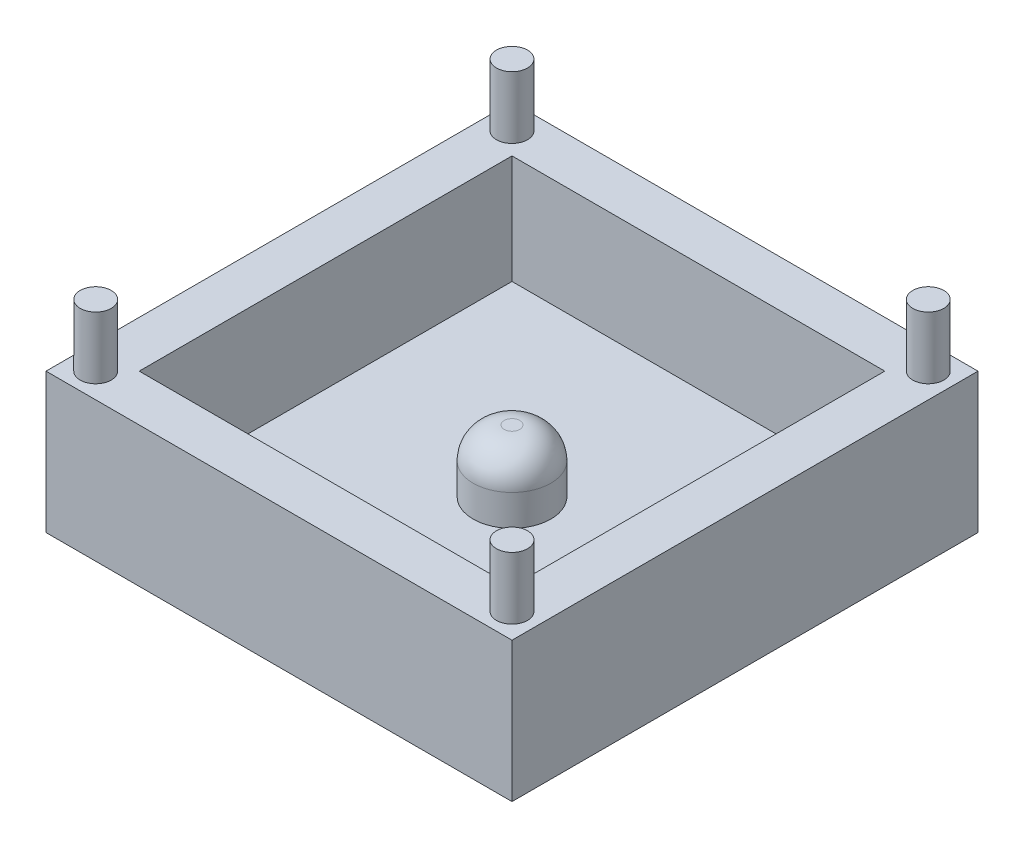
ISO-10303-21;
HEADER;
FILE_DESCRIPTION(('STEP AP214'),'2;1');
FILE_NAME('part.step','',(''),(''),'','','');
FILE_SCHEMA(('AUTOMOTIVE_DESIGN { 1 0 10303 214 1 1 1 1 }'));
ENDSEC;
DATA;
#1=APPLICATION_CONTEXT('core data for automotive mechanical design processes');
#2=APPLICATION_PROTOCOL_DEFINITION('international standard','automotive_design',2000,#1);
#3=PRODUCT_CONTEXT('',#1,'mechanical');
#4=PRODUCT('Part','Part','',(#3));
#5=PRODUCT_RELATED_PRODUCT_CATEGORY('part','',(#4));
#6=PRODUCT_DEFINITION_FORMATION('','',#4);
#7=PRODUCT_DEFINITION_CONTEXT('part definition',#1,'design');
#8=PRODUCT_DEFINITION('design','',#6,#7);
#9=PRODUCT_DEFINITION_SHAPE('','',#8);
#10=(LENGTH_UNIT() NAMED_UNIT(*) SI_UNIT(.MILLI.,.METRE.));
#11=(NAMED_UNIT(*) PLANE_ANGLE_UNIT() SI_UNIT($,.RADIAN.));
#12=(NAMED_UNIT(*) SI_UNIT($,.STERADIAN.) SOLID_ANGLE_UNIT());
#13=UNCERTAINTY_MEASURE_WITH_UNIT(LENGTH_MEASURE(1.E-05),#10,'distance_accuracy_value','');
#14=(GEOMETRIC_REPRESENTATION_CONTEXT(3) GLOBAL_UNCERTAINTY_ASSIGNED_CONTEXT((#13)) GLOBAL_UNIT_ASSIGNED_CONTEXT((#10,
#11,#12)) REPRESENTATION_CONTEXT('',''));
#15=CARTESIAN_POINT('',(0.,0.,0.));
#16=DIRECTION('',(0.,0.,1.));
#17=DIRECTION('',(1.,0.,0.));
#18=AXIS2_PLACEMENT_3D('',#15,#16,#17);
#19=CARTESIAN_POINT('',(7.5,4.5,7.5));
#20=DIRECTION('',(-1.,0.,0.));
#21=DIRECTION('',(0.,0.,1.));
#22=AXIS2_PLACEMENT_3D('',#19,#20,#21);
#23=PLANE('',#22);
#24=DIRECTION('',(0.,0.,-1.));
#25=VECTOR('',#24,1.);
#26=CARTESIAN_POINT('',(7.5,0.,7.5));
#27=LINE('',#26,#25);
#28=CARTESIAN_POINT('',(7.5,0.,7.5));
#29=VERTEX_POINT('',#28);
#30=CARTESIAN_POINT('',(7.5,0.,-7.5));
#31=VERTEX_POINT('',#30);
#32=EDGE_CURVE('E146',#29,#31,#27,.T.);
#33=ORIENTED_EDGE('',*,*,#32,.T.);
#34=DIRECTION('',(0.,-1.,0.));
#35=VECTOR('',#34,1.);
#36=CARTESIAN_POINT('',(7.5,4.5,-7.5));
#37=LINE('',#36,#35);
#38=CARTESIAN_POINT('',(7.5,4.5,-7.5));
#39=VERTEX_POINT('',#38);
#40=EDGE_CURVE('E170',#39,#31,#37,.T.);
#41=ORIENTED_EDGE('',*,*,#40,.F.);
#42=DIRECTION('',(0.,0.,-1.));
#43=VECTOR('',#42,1.);
#44=CARTESIAN_POINT('',(7.5,4.5,7.5));
#45=LINE('',#44,#43);
#46=CARTESIAN_POINT('',(7.5,4.5,7.5));
#47=VERTEX_POINT('',#46);
#48=EDGE_CURVE('E150',#47,#39,#45,.T.);
#49=ORIENTED_EDGE('',*,*,#48,.F.);
#50=DIRECTION('',(0.,-1.,0.));
#51=VECTOR('',#50,1.);
#52=CARTESIAN_POINT('',(7.5,4.5,7.5));
#53=LINE('',#52,#51);
#54=EDGE_CURVE('E156',#47,#29,#53,.T.);
#55=ORIENTED_EDGE('',*,*,#54,.T.);
#56=EDGE_LOOP('',(#33,#41,#49,#55));
#57=FACE_BOUND('',#56,.T.);
#58=ADVANCED_FACE('F33',(#57),#23,.F.);
#59=CARTESIAN_POINT('',(-7.5,4.5,-7.5));
#60=DIRECTION('',(0.,0.,1.));
#61=DIRECTION('',(1.,0.,0.));
#62=AXIS2_PLACEMENT_3D('',#59,#60,#61);
#63=PLANE('',#62);
#64=DIRECTION('',(-1.,0.,0.));
#65=VECTOR('',#64,1.);
#66=CARTESIAN_POINT('',(-7.5,0.,-7.5));
#67=LINE('',#66,#65);
#68=CARTESIAN_POINT('',(-7.5,0.,-7.5));
#69=VERTEX_POINT('',#68);
#70=EDGE_CURVE('E159',#31,#69,#67,.T.);
#71=ORIENTED_EDGE('',*,*,#70,.T.);
#72=DIRECTION('',(0.,-1.,0.));
#73=VECTOR('',#72,1.);
#74=CARTESIAN_POINT('',(-7.5,4.5,-7.5));
#75=LINE('',#74,#73);
#76=CARTESIAN_POINT('',(-7.5,4.5,-7.5));
#77=VERTEX_POINT('',#76);
#78=EDGE_CURVE('E167',#77,#69,#75,.T.);
#79=ORIENTED_EDGE('',*,*,#78,.F.);
#80=DIRECTION('',(-1.,0.,0.));
#81=VECTOR('',#80,1.);
#82=CARTESIAN_POINT('',(-7.5,4.5,-7.5));
#83=LINE('',#82,#81);
#84=EDGE_CURVE('E86',#39,#77,#83,.T.);
#85=ORIENTED_EDGE('',*,*,#84,.F.);
#86=ORIENTED_EDGE('',*,*,#40,.T.);
#87=EDGE_LOOP('',(#71,#79,#85,#86));
#88=FACE_BOUND('',#87,.T.);
#89=ADVANCED_FACE('F207',(#88),#63,.F.);
#90=CARTESIAN_POINT('',(-7.5,4.5,7.5));
#91=DIRECTION('',(1.,0.,0.));
#92=DIRECTION('',(0.,0.,-1.));
#93=AXIS2_PLACEMENT_3D('',#90,#91,#92);
#94=PLANE('',#93);
#95=DIRECTION('',(0.,0.,1.));
#96=VECTOR('',#95,1.);
#97=CARTESIAN_POINT('',(-7.5,0.,7.5));
#98=LINE('',#97,#96);
#99=CARTESIAN_POINT('',(-7.5,0.,7.5));
#100=VERTEX_POINT('',#99);
#101=EDGE_CURVE('E161',#69,#100,#98,.T.);
#102=ORIENTED_EDGE('',*,*,#101,.T.);
#103=DIRECTION('',(0.,-1.,0.));
#104=VECTOR('',#103,1.);
#105=CARTESIAN_POINT('',(-7.5,4.5,7.5));
#106=LINE('',#105,#104);
#107=CARTESIAN_POINT('',(-7.5,4.5,7.5));
#108=VERTEX_POINT('',#107);
#109=EDGE_CURVE('E165',#108,#100,#106,.T.);
#110=ORIENTED_EDGE('',*,*,#109,.F.);
#111=DIRECTION('',(0.,0.,1.));
#112=VECTOR('',#111,1.);
#113=CARTESIAN_POINT('',(-7.5,4.5,7.5));
#114=LINE('',#113,#112);
#115=EDGE_CURVE('E153',#77,#108,#114,.T.);
#116=ORIENTED_EDGE('',*,*,#115,.F.);
#117=ORIENTED_EDGE('',*,*,#78,.T.);
#118=EDGE_LOOP('',(#102,#110,#116,#117));
#119=FACE_BOUND('',#118,.T.);
#120=ADVANCED_FACE('F212',(#119),#94,.F.);
#121=CARTESIAN_POINT('',(-7.5,4.5,7.5));
#122=DIRECTION('',(0.,0.,-1.));
#123=DIRECTION('',(-1.,0.,0.));
#124=AXIS2_PLACEMENT_3D('',#121,#122,#123);
#125=PLANE('',#124);
#126=DIRECTION('',(1.,0.,0.));
#127=VECTOR('',#126,1.);
#128=CARTESIAN_POINT('',(-7.5,0.,7.5));
#129=LINE('',#128,#127);
#130=EDGE_CURVE('E78',#100,#29,#129,.T.);
#131=ORIENTED_EDGE('',*,*,#130,.T.);
#132=ORIENTED_EDGE('',*,*,#54,.F.);
#133=DIRECTION('',(1.,0.,0.));
#134=VECTOR('',#133,1.);
#135=CARTESIAN_POINT('',(-7.5,4.5,7.5));
#136=LINE('',#135,#134);
#137=EDGE_CURVE('E57',#108,#47,#136,.T.);
#138=ORIENTED_EDGE('',*,*,#137,.F.);
#139=ORIENTED_EDGE('',*,*,#109,.T.);
#140=EDGE_LOOP('',(#131,#132,#138,#139));
#141=FACE_BOUND('',#140,.T.);
#142=ADVANCED_FACE('F195',(#141),#125,.F.);
#143=CARTESIAN_POINT('',(0.,4.5,0.));
#144=DIRECTION('',(0.,-1.,0.));
#145=DIRECTION('',(0.,0.,-1.));
#146=AXIS2_PLACEMENT_3D('',#143,#144,#145);
#147=PLANE('',#146);
#148=CARTESIAN_POINT('',(-6.7,4.5,6.7));
#149=DIRECTION('',(0.,-1.,0.));
#150=DIRECTION('',(0.,0.,-1.));
#151=AXIS2_PLACEMENT_3D('',#148,#149,#150);
#152=CIRCLE('',#151,0.500000000000001);
#153=CARTESIAN_POINT('',(-6.7,4.5,6.2));
#154=VERTEX_POINT('',#153);
#155=EDGE_CURVE('E11',#154,#154,#152,.F.);
#156=ORIENTED_EDGE('',*,*,#155,.F.);
#157=EDGE_LOOP('',(#156));
#158=FACE_BOUND('',#157,.T.);
#159=CARTESIAN_POINT('',(6.7,4.5,6.7));
#160=DIRECTION('',(0.,-1.,0.));
#161=DIRECTION('',(0.,0.,-1.));
#162=AXIS2_PLACEMENT_3D('',#159,#160,#161);
#163=CIRCLE('',#162,0.500000000000001);
#164=CARTESIAN_POINT('',(6.7,4.5,6.2));
#165=VERTEX_POINT('',#164);
#166=EDGE_CURVE('E41',#165,#165,#163,.F.);
#167=ORIENTED_EDGE('',*,*,#166,.F.);
#168=EDGE_LOOP('',(#167));
#169=FACE_BOUND('',#168,.T.);
#170=CARTESIAN_POINT('',(6.7,4.5,-6.7));
#171=DIRECTION('',(0.,-1.,0.));
#172=DIRECTION('',(0.,0.,-1.));
#173=AXIS2_PLACEMENT_3D('',#170,#171,#172);
#174=CIRCLE('',#173,0.500000000000001);
#175=CARTESIAN_POINT('',(6.7,4.5,-7.2));
#176=VERTEX_POINT('',#175);
#177=EDGE_CURVE('E184',#176,#176,#174,.F.);
#178=ORIENTED_EDGE('',*,*,#177,.F.);
#179=EDGE_LOOP('',(#178));
#180=FACE_BOUND('',#179,.T.);
#181=CARTESIAN_POINT('',(-6.7,4.5,-6.7));
#182=DIRECTION('',(0.,-1.,0.));
#183=DIRECTION('',(0.,0.,-1.));
#184=AXIS2_PLACEMENT_3D('',#181,#182,#183);
#185=CIRCLE('',#184,0.500000000000001);
#186=CARTESIAN_POINT('',(-6.7,4.5,-7.2));
#187=VERTEX_POINT('',#186);
#188=EDGE_CURVE('E181',#187,#187,#185,.F.);
#189=ORIENTED_EDGE('',*,*,#188,.F.);
#190=EDGE_LOOP('',(#189));
#191=FACE_BOUND('',#190,.T.);
#192=DIRECTION('',(-1.,0.,0.));
#193=VECTOR('',#192,1.);
#194=CARTESIAN_POINT('',(-6.,4.5,-6.));
#195=LINE('',#194,#193);
#196=CARTESIAN_POINT('',(6.,4.5,-6.));
#197=VERTEX_POINT('',#196);
#198=CARTESIAN_POINT('',(-6.,4.5,-6.));
#199=VERTEX_POINT('',#198);
#200=EDGE_CURVE('E140',#197,#199,#195,.T.);
#201=ORIENTED_EDGE('',*,*,#200,.F.);
#202=DIRECTION('',(0.,0.,-1.));
#203=VECTOR('',#202,1.);
#204=CARTESIAN_POINT('',(6.,4.5,6.));
#205=LINE('',#204,#203);
#206=CARTESIAN_POINT('',(6.,4.5,6.));
#207=VERTEX_POINT('',#206);
#208=EDGE_CURVE('E48',#207,#197,#205,.T.);
#209=ORIENTED_EDGE('',*,*,#208,.F.);
#210=DIRECTION('',(1.,0.,0.));
#211=VECTOR('',#210,1.);
#212=CARTESIAN_POINT('',(-6.,4.5,6.));
#213=LINE('',#212,#211);
#214=CARTESIAN_POINT('',(-6.,4.5,6.));
#215=VERTEX_POINT('',#214);
#216=EDGE_CURVE('E128',#215,#207,#213,.T.);
#217=ORIENTED_EDGE('',*,*,#216,.F.);
#218=DIRECTION('',(0.,0.,1.));
#219=VECTOR('',#218,1.);
#220=CARTESIAN_POINT('',(-6.,4.5,6.));
#221=LINE('',#220,#219);
#222=EDGE_CURVE('E131',#199,#215,#221,.T.);
#223=ORIENTED_EDGE('',*,*,#222,.F.);
#224=EDGE_LOOP('',(#201,#209,#217,#223));
#225=FACE_BOUND('',#224,.T.);
#226=ORIENTED_EDGE('',*,*,#48,.T.);
#227=ORIENTED_EDGE('',*,*,#84,.T.);
#228=ORIENTED_EDGE('',*,*,#115,.T.);
#229=ORIENTED_EDGE('',*,*,#137,.T.);
#230=EDGE_LOOP('',(#226,#227,#228,#229));
#231=FACE_BOUND('',#230,.T.);
#232=ADVANCED_FACE('F191',(#158,#169,#180,#191,#225,#231),#147,.F.);
#233=CARTESIAN_POINT('',(0.,0.,0.));
#234=DIRECTION('',(0.,-1.,0.));
#235=DIRECTION('',(0.,0.,-1.));
#236=AXIS2_PLACEMENT_3D('',#233,#234,#235);
#237=PLANE('',#236);
#238=ORIENTED_EDGE('',*,*,#32,.F.);
#239=ORIENTED_EDGE('',*,*,#130,.F.);
#240=ORIENTED_EDGE('',*,*,#101,.F.);
#241=ORIENTED_EDGE('',*,*,#70,.F.);
#242=EDGE_LOOP('',(#238,#239,#240,#241));
#243=FACE_BOUND('',#242,.T.);
#244=ADVANCED_FACE('F194',(#243),#237,.T.);
#245=CARTESIAN_POINT('',(6.,1.,6.));
#246=DIRECTION('',(1.,0.,0.));
#247=DIRECTION('',(0.,0.,-1.));
#248=AXIS2_PLACEMENT_3D('',#245,#246,#247);
#249=PLANE('',#248);
#250=ORIENTED_EDGE('',*,*,#208,.T.);
#251=DIRECTION('',(0.,1.,0.));
#252=VECTOR('',#251,1.);
#253=CARTESIAN_POINT('',(6.,1.,-6.));
#254=LINE('',#253,#252);
#255=CARTESIAN_POINT('',(6.,1.,-6.));
#256=VERTEX_POINT('',#255);
#257=EDGE_CURVE('E106',#256,#197,#254,.T.);
#258=ORIENTED_EDGE('',*,*,#257,.F.);
#259=DIRECTION('',(0.,0.,-1.));
#260=VECTOR('',#259,1.);
#261=CARTESIAN_POINT('',(6.,1.,6.));
#262=LINE('',#261,#260);
#263=CARTESIAN_POINT('',(6.,1.,6.));
#264=VERTEX_POINT('',#263);
#265=EDGE_CURVE('E110',#264,#256,#262,.T.);
#266=ORIENTED_EDGE('',*,*,#265,.F.);
#267=DIRECTION('',(0.,1.,0.));
#268=VECTOR('',#267,1.);
#269=CARTESIAN_POINT('',(6.,1.,6.));
#270=LINE('',#269,#268);
#271=EDGE_CURVE('E144',#264,#207,#270,.T.);
#272=ORIENTED_EDGE('',*,*,#271,.T.);
#273=EDGE_LOOP('',(#250,#258,#266,#272));
#274=FACE_BOUND('',#273,.T.);
#275=ADVANCED_FACE('F108',(#274),#249,.F.);
#276=CARTESIAN_POINT('',(-6.,1.,6.));
#277=DIRECTION('',(0.,0.,1.));
#278=DIRECTION('',(1.,0.,0.));
#279=AXIS2_PLACEMENT_3D('',#276,#277,#278);
#280=PLANE('',#279);
#281=ORIENTED_EDGE('',*,*,#216,.T.);
#282=ORIENTED_EDGE('',*,*,#271,.F.);
#283=DIRECTION('',(1.,0.,0.));
#284=VECTOR('',#283,1.);
#285=CARTESIAN_POINT('',(-6.,1.,6.));
#286=LINE('',#285,#284);
#287=CARTESIAN_POINT('',(-6.,1.,6.));
#288=VERTEX_POINT('',#287);
#289=EDGE_CURVE('E116',#288,#264,#286,.T.);
#290=ORIENTED_EDGE('',*,*,#289,.F.);
#291=DIRECTION('',(0.,1.,0.));
#292=VECTOR('',#291,1.);
#293=CARTESIAN_POINT('',(-6.,1.,6.));
#294=LINE('',#293,#292);
#295=EDGE_CURVE('E147',#288,#215,#294,.T.);
#296=ORIENTED_EDGE('',*,*,#295,.T.);
#297=EDGE_LOOP('',(#281,#282,#290,#296));
#298=FACE_BOUND('',#297,.T.);
#299=ADVANCED_FACE('F219',(#298),#280,.F.);
#300=CARTESIAN_POINT('',(-6.,1.,6.));
#301=DIRECTION('',(-1.,0.,0.));
#302=DIRECTION('',(0.,0.,1.));
#303=AXIS2_PLACEMENT_3D('',#300,#301,#302);
#304=PLANE('',#303);
#305=ORIENTED_EDGE('',*,*,#222,.T.);
#306=ORIENTED_EDGE('',*,*,#295,.F.);
#307=DIRECTION('',(0.,0.,1.));
#308=VECTOR('',#307,1.);
#309=CARTESIAN_POINT('',(-6.,1.,6.));
#310=LINE('',#309,#308);
#311=CARTESIAN_POINT('',(-6.,1.,-6.));
#312=VERTEX_POINT('',#311);
#313=EDGE_CURVE('E124',#312,#288,#310,.T.);
#314=ORIENTED_EDGE('',*,*,#313,.F.);
#315=DIRECTION('',(0.,1.,0.));
#316=VECTOR('',#315,1.);
#317=CARTESIAN_POINT('',(-6.,1.,-6.));
#318=LINE('',#317,#316);
#319=EDGE_CURVE('E115',#312,#199,#318,.T.);
#320=ORIENTED_EDGE('',*,*,#319,.T.);
#321=EDGE_LOOP('',(#305,#306,#314,#320));
#322=FACE_BOUND('',#321,.T.);
#323=ADVANCED_FACE('F342',(#322),#304,.F.);
#324=CARTESIAN_POINT('',(-6.,1.,-6.));
#325=DIRECTION('',(0.,0.,-1.));
#326=DIRECTION('',(-1.,0.,0.));
#327=AXIS2_PLACEMENT_3D('',#324,#325,#326);
#328=PLANE('',#327);
#329=ORIENTED_EDGE('',*,*,#200,.T.);
#330=ORIENTED_EDGE('',*,*,#319,.F.);
#331=DIRECTION('',(-1.,0.,0.));
#332=VECTOR('',#331,1.);
#333=CARTESIAN_POINT('',(-6.,1.,-6.));
#334=LINE('',#333,#332);
#335=EDGE_CURVE('E119',#256,#312,#334,.T.);
#336=ORIENTED_EDGE('',*,*,#335,.F.);
#337=ORIENTED_EDGE('',*,*,#257,.T.);
#338=EDGE_LOOP('',(#329,#330,#336,#337));
#339=FACE_BOUND('',#338,.T.);
#340=ADVANCED_FACE('F120',(#339),#328,.F.);
#341=CARTESIAN_POINT('',(0.,1.,0.));
#342=DIRECTION('',(0.,-1.,0.));
#343=DIRECTION('',(0.,0.,-1.));
#344=AXIS2_PLACEMENT_3D('',#341,#342,#343);
#345=PLANE('',#344);
#346=CARTESIAN_POINT('',(0.,1.,0.));
#347=DIRECTION('',(0.,-1.,0.));
#348=DIRECTION('',(0.,0.,-1.));
#349=AXIS2_PLACEMENT_3D('',#346,#347,#348);
#350=CIRCLE('',#349,1.25);
#351=CARTESIAN_POINT('',(0.,1.,-1.25));
#352=VERTEX_POINT('',#351);
#353=EDGE_CURVE('E172',#352,#352,#350,.F.);
#354=ORIENTED_EDGE('',*,*,#353,.F.);
#355=EDGE_LOOP('',(#354));
#356=FACE_BOUND('',#355,.T.);
#357=ORIENTED_EDGE('',*,*,#265,.T.);
#358=ORIENTED_EDGE('',*,*,#335,.T.);
#359=ORIENTED_EDGE('',*,*,#313,.T.);
#360=ORIENTED_EDGE('',*,*,#289,.T.);
#361=EDGE_LOOP('',(#357,#358,#359,#360));
#362=FACE_BOUND('',#361,.T.);
#363=ADVANCED_FACE('F126',(#356,#362),#345,.F.);
#364=CARTESIAN_POINT('',(0.,3.,0.));
#365=DIRECTION('',(0.,-1.,0.));
#366=DIRECTION('',(0.,0.,-1.));
#367=AXIS2_PLACEMENT_3D('',#364,#365,#366);
#368=CYLINDRICAL_SURFACE('',#367,1.25);
#369=CARTESIAN_POINT('',(0.,2.,0.));
#370=DIRECTION('',(0.,1.,0.));
#371=DIRECTION('',(0.,0.,1.));
#372=AXIS2_PLACEMENT_3D('',#369,#370,#371);
#373=CIRCLE('',#372,1.25);
#374=CARTESIAN_POINT('',(0.,2.,1.25));
#375=VERTEX_POINT('',#374);
#376=EDGE_CURVE('E178',#375,#375,#373,.F.);
#377=ORIENTED_EDGE('',*,*,#376,.T.);
#378=EDGE_LOOP('',(#377));
#379=FACE_BOUND('',#378,.T.);
#380=ORIENTED_EDGE('',*,*,#353,.T.);
#381=EDGE_LOOP('',(#380));
#382=FACE_BOUND('',#381,.T.);
#383=ADVANCED_FACE('F332',(#379,#382),#368,.T.);
#384=CARTESIAN_POINT('',(0.,3.,0.));
#385=DIRECTION('',(0.,1.,0.));
#386=DIRECTION('',(0.,0.,1.));
#387=AXIS2_PLACEMENT_3D('',#384,#385,#386);
#388=PLANE('',#387);
#389=CARTESIAN_POINT('',(0.,3.,0.));
#390=DIRECTION('',(0.,1.,0.));
#391=DIRECTION('',(0.,0.,1.));
#392=AXIS2_PLACEMENT_3D('',#389,#390,#391);
#393=CIRCLE('',#392,0.25);
#394=CARTESIAN_POINT('',(0.,3.,0.25));
#395=VERTEX_POINT('',#394);
#396=EDGE_CURVE('E175',#395,#395,#393,.T.);
#397=ORIENTED_EDGE('',*,*,#396,.T.);
#398=EDGE_LOOP('',(#397));
#399=FACE_BOUND('',#398,.T.);
#400=ADVANCED_FACE('F329',(#399),#388,.T.);
#401=CARTESIAN_POINT('',(0.,2.,0.));
#402=DIRECTION('',(0.,1.,0.));
#403=DIRECTION('',(0.,0.,1.));
#404=AXIS2_PLACEMENT_3D('',#401,#402,#403);
#405=DEGENERATE_TOROIDAL_SURFACE('',#404,0.25,1.,.T.);
#406=ORIENTED_EDGE('',*,*,#376,.F.);
#407=EDGE_LOOP('',(#406));
#408=FACE_BOUND('',#407,.T.);
#409=ORIENTED_EDGE('',*,*,#396,.F.);
#410=EDGE_LOOP('',(#409));
#411=FACE_BOUND('',#410,.T.);
#412=ADVANCED_FACE('F35',(#408,#411),#405,.T.);
#413=CARTESIAN_POINT('',(-6.7,6.5,-6.7));
#414=DIRECTION('',(0.,-1.,0.));
#415=DIRECTION('',(0.,0.,-1.));
#416=AXIS2_PLACEMENT_3D('',#413,#414,#415);
#417=CYLINDRICAL_SURFACE('',#416,0.500000000000001);
#418=CARTESIAN_POINT('',(-6.7,6.5,-6.7));
#419=DIRECTION('',(0.,1.,0.));
#420=DIRECTION('',(0.,0.,1.));
#421=AXIS2_PLACEMENT_3D('',#418,#419,#420);
#422=CIRCLE('',#421,0.500000000000001);
#423=CARTESIAN_POINT('',(-6.7,6.5,-6.2));
#424=VERTEX_POINT('',#423);
#425=EDGE_CURVE('E134',#424,#424,#422,.T.);
#426=ORIENTED_EDGE('',*,*,#425,.F.);
#427=EDGE_LOOP('',(#426));
#428=FACE_BOUND('',#427,.T.);
#429=ORIENTED_EDGE('',*,*,#188,.T.);
#430=EDGE_LOOP('',(#429));
#431=FACE_BOUND('',#430,.T.);
#432=ADVANCED_FACE('F249',(#428,#431),#417,.T.);
#433=CARTESIAN_POINT('',(-6.7,6.5,-6.7));
#434=DIRECTION('',(0.,1.,0.));
#435=DIRECTION('',(0.,0.,1.));
#436=AXIS2_PLACEMENT_3D('',#433,#434,#435);
#437=PLANE('',#436);
#438=ORIENTED_EDGE('',*,*,#425,.T.);
#439=EDGE_LOOP('',(#438));
#440=FACE_BOUND('',#439,.T.);
#441=ADVANCED_FACE('F254',(#440),#437,.T.);
#442=CARTESIAN_POINT('',(6.7,6.5,-6.7));
#443=DIRECTION('',(0.,-1.,0.));
#444=DIRECTION('',(0.,0.,-1.));
#445=AXIS2_PLACEMENT_3D('',#442,#443,#444);
#446=CYLINDRICAL_SURFACE('',#445,0.500000000000001);
#447=CARTESIAN_POINT('',(6.7,6.5,-6.7));
#448=DIRECTION('',(0.,1.,0.));
#449=DIRECTION('',(0.,0.,1.));
#450=AXIS2_PLACEMENT_3D('',#447,#448,#449);
#451=CIRCLE('',#450,0.500000000000001);
#452=CARTESIAN_POINT('',(6.7,6.5,-6.2));
#453=VERTEX_POINT('',#452);
#454=EDGE_CURVE('E407',#453,#453,#451,.T.);
#455=ORIENTED_EDGE('',*,*,#454,.F.);
#456=EDGE_LOOP('',(#455));
#457=FACE_BOUND('',#456,.T.);
#458=ORIENTED_EDGE('',*,*,#177,.T.);
#459=EDGE_LOOP('',(#458));
#460=FACE_BOUND('',#459,.T.);
#461=ADVANCED_FACE('F264',(#457,#460),#446,.T.);
#462=CARTESIAN_POINT('',(6.7,6.5,-6.7));
#463=DIRECTION('',(0.,1.,0.));
#464=DIRECTION('',(0.,0.,1.));
#465=AXIS2_PLACEMENT_3D('',#462,#463,#464);
#466=PLANE('',#465);
#467=ORIENTED_EDGE('',*,*,#454,.T.);
#468=EDGE_LOOP('',(#467));
#469=FACE_BOUND('',#468,.T.);
#470=ADVANCED_FACE('F274',(#469),#466,.T.);
#471=CARTESIAN_POINT('',(6.7,6.5,6.7));
#472=DIRECTION('',(0.,-1.,0.));
#473=DIRECTION('',(0.,0.,-1.));
#474=AXIS2_PLACEMENT_3D('',#471,#472,#473);
#475=CYLINDRICAL_SURFACE('',#474,0.500000000000001);
#476=CARTESIAN_POINT('',(6.7,6.5,6.7));
#477=DIRECTION('',(0.,1.,0.));
#478=DIRECTION('',(0.,0.,1.));
#479=AXIS2_PLACEMENT_3D('',#476,#477,#478);
#480=CIRCLE('',#479,0.500000000000001);
#481=CARTESIAN_POINT('',(6.7,6.5,7.2));
#482=VERTEX_POINT('',#481);
#483=EDGE_CURVE('E404',#482,#482,#480,.T.);
#484=ORIENTED_EDGE('',*,*,#483,.F.);
#485=EDGE_LOOP('',(#484));
#486=FACE_BOUND('',#485,.T.);
#487=ORIENTED_EDGE('',*,*,#166,.T.);
#488=EDGE_LOOP('',(#487));
#489=FACE_BOUND('',#488,.T.);
#490=ADVANCED_FACE('F189',(#486,#489),#475,.T.);
#491=CARTESIAN_POINT('',(6.7,6.5,6.7));
#492=DIRECTION('',(0.,1.,0.));
#493=DIRECTION('',(0.,0.,1.));
#494=AXIS2_PLACEMENT_3D('',#491,#492,#493);
#495=PLANE('',#494);
#496=ORIENTED_EDGE('',*,*,#483,.T.);
#497=EDGE_LOOP('',(#496));
#498=FACE_BOUND('',#497,.T.);
#499=ADVANCED_FACE('F293',(#498),#495,.T.);
#500=CARTESIAN_POINT('',(-6.7,6.5,6.7));
#501=DIRECTION('',(0.,-1.,0.));
#502=DIRECTION('',(0.,0.,-1.));
#503=AXIS2_PLACEMENT_3D('',#500,#501,#502);
#504=CYLINDRICAL_SURFACE('',#503,0.500000000000001);
#505=CARTESIAN_POINT('',(-6.7,6.5,6.7));
#506=DIRECTION('',(0.,1.,0.));
#507=DIRECTION('',(0.,0.,1.));
#508=AXIS2_PLACEMENT_3D('',#505,#506,#507);
#509=CIRCLE('',#508,0.500000000000001);
#510=CARTESIAN_POINT('',(-6.7,6.5,7.2));
#511=VERTEX_POINT('',#510);
#512=EDGE_CURVE('E403',#511,#511,#509,.T.);
#513=ORIENTED_EDGE('',*,*,#512,.F.);
#514=EDGE_LOOP('',(#513));
#515=FACE_BOUND('',#514,.T.);
#516=ORIENTED_EDGE('',*,*,#155,.T.);
#517=EDGE_LOOP('',(#516));
#518=FACE_BOUND('',#517,.T.);
#519=ADVANCED_FACE('F303',(#515,#518),#504,.T.);
#520=CARTESIAN_POINT('',(-6.7,6.5,6.7));
#521=DIRECTION('',(0.,1.,0.));
#522=DIRECTION('',(0.,0.,1.));
#523=AXIS2_PLACEMENT_3D('',#520,#521,#522);
#524=PLANE('',#523);
#525=ORIENTED_EDGE('',*,*,#512,.T.);
#526=EDGE_LOOP('',(#525));
#527=FACE_BOUND('',#526,.T.);
#528=ADVANCED_FACE('F313',(#527),#524,.T.);
#529=CLOSED_SHELL('',(#58,#89,#120,#142,#232,#244,#275,#299,#323,#340,#363,#383,#400,#412,#432,
#441,#461,#470,#490,#499,#519,#528));
#530=MANIFOLD_SOLID_BREP('B2',#529);
#531=ADVANCED_BREP_SHAPE_REPRESENTATION('',(#18,#530),#14);
#532=SHAPE_DEFINITION_REPRESENTATION(#9,#531);
ENDSEC;
END-ISO-10303-21;
